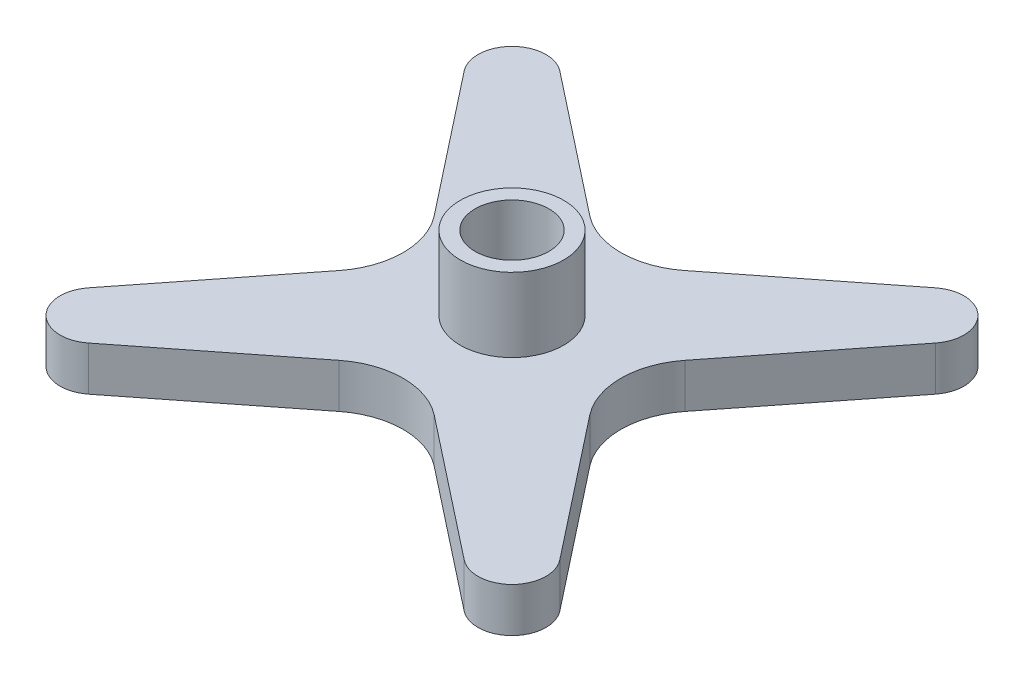
ISO-10303-21;
HEADER;
FILE_DESCRIPTION(('STEP AP214'),'2;1');
FILE_NAME('part.step','',(''),(''),'','','');
FILE_SCHEMA(('AUTOMOTIVE_DESIGN { 1 0 10303 214 1 1 1 1 }'));
ENDSEC;
DATA;
#1=APPLICATION_CONTEXT('core data for automotive mechanical design processes');
#2=APPLICATION_PROTOCOL_DEFINITION('international standard','automotive_design',2000,#1);
#3=PRODUCT_CONTEXT('',#1,'mechanical');
#4=PRODUCT('Part','Part','',(#3));
#5=PRODUCT_RELATED_PRODUCT_CATEGORY('part','',(#4));
#6=PRODUCT_DEFINITION_FORMATION('','',#4);
#7=PRODUCT_DEFINITION_CONTEXT('part definition',#1,'design');
#8=PRODUCT_DEFINITION('design','',#6,#7);
#9=PRODUCT_DEFINITION_SHAPE('','',#8);
#10=(LENGTH_UNIT() NAMED_UNIT(*) SI_UNIT(.MILLI.,.METRE.));
#11=(NAMED_UNIT(*) PLANE_ANGLE_UNIT() SI_UNIT($,.RADIAN.));
#12=(NAMED_UNIT(*) SI_UNIT($,.STERADIAN.) SOLID_ANGLE_UNIT());
#13=UNCERTAINTY_MEASURE_WITH_UNIT(LENGTH_MEASURE(1.E-05),#10,'distance_accuracy_value','');
#14=(GEOMETRIC_REPRESENTATION_CONTEXT(3) GLOBAL_UNCERTAINTY_ASSIGNED_CONTEXT((#13)) GLOBAL_UNIT_ASSIGNED_CONTEXT((#10,
#11,#12)) REPRESENTATION_CONTEXT('',''));
#15=CARTESIAN_POINT('',(0.,0.,0.));
#16=DIRECTION('',(0.,0.,1.));
#17=DIRECTION('',(1.,0.,0.));
#18=AXIS2_PLACEMENT_3D('',#15,#16,#17);
#19=CARTESIAN_POINT('',(14.142135623731,25.,-14.1421356237309));
#20=DIRECTION('',(0.,-1.,0.));
#21=DIRECTION('',(0.,0.,-1.));
#22=AXIS2_PLACEMENT_3D('',#19,#20,#21);
#23=CYLINDRICAL_SURFACE('',#22,2.3036334435409);
#24=CARTESIAN_POINT('',(14.142135623731,22.,-14.1421356237309));
#25=DIRECTION('',(0.,1.,0.));
#26=DIRECTION('',(0.,0.,1.));
#27=AXIS2_PLACEMENT_3D('',#24,#25,#26);
#28=CIRCLE('',#27,2.3036334435409);
#29=CARTESIAN_POINT('',(15.9528166490308,22.,-12.7180003538848));
#30=VERTEX_POINT('',#29);
#31=CARTESIAN_POINT('',(12.7180003538849,22.,-15.9528166490306));
#32=VERTEX_POINT('',#31);
#33=EDGE_CURVE('E184',#30,#32,#28,.T.);
#34=ORIENTED_EDGE('',*,*,#33,.T.);
#35=DIRECTION('',(0.,-1.,0.));
#36=VECTOR('',#35,1.);
#37=CARTESIAN_POINT('',(12.7180003538849,25.,-15.9528166490306));
#38=LINE('',#37,#36);
#39=CARTESIAN_POINT('',(12.7180003538849,25.,-15.9528166490306));
#40=VERTEX_POINT('',#39);
#41=EDGE_CURVE('E47',#40,#32,#38,.T.);
#42=ORIENTED_EDGE('',*,*,#41,.F.);
#43=CARTESIAN_POINT('',(14.142135623731,25.,-14.1421356237309));
#44=DIRECTION('',(0.,1.,0.));
#45=DIRECTION('',(0.,0.,1.));
#46=AXIS2_PLACEMENT_3D('',#43,#44,#45);
#47=CIRCLE('',#46,2.3036334435409);
#48=CARTESIAN_POINT('',(15.9528166490308,25.,-12.7180003538848));
#49=VERTEX_POINT('',#48);
#50=EDGE_CURVE('E215',#49,#40,#47,.T.);
#51=ORIENTED_EDGE('',*,*,#50,.F.);
#52=DIRECTION('',(0.,-1.,0.));
#53=VECTOR('',#52,1.);
#54=CARTESIAN_POINT('',(15.9528166490308,25.,-12.7180003538848));
#55=LINE('',#54,#53);
#56=EDGE_CURVE('E180',#49,#30,#55,.T.);
#57=ORIENTED_EDGE('',*,*,#56,.T.);
#58=EDGE_LOOP('',(#34,#42,#51,#57));
#59=FACE_BOUND('',#58,.T.);
#60=ADVANCED_FACE('F39',(#59),#23,.T.);
#61=CARTESIAN_POINT('',(12.7180003538849,25.,-15.9528166490306));
#62=DIRECTION('',(0.618212621386955,0.,0.786010912620092));
#63=DIRECTION('',(0.786010912620092,0.,-0.618212621386955));
#64=AXIS2_PLACEMENT_3D('',#61,#62,#63);
#65=PLANE('',#64);
#66=DIRECTION('',(-0.786010912620092,0.,0.618212621386955));
#67=VECTOR('',#66,1.);
#68=CARTESIAN_POINT('',(12.7180003538849,22.,-15.9528166490306));
#69=LINE('',#68,#67);
#70=CARTESIAN_POINT('',(3.21470563121222,22.,-8.47829352474935));
#71=VERTEX_POINT('',#70);
#72=EDGE_CURVE('E187',#32,#71,#69,.T.);
#73=ORIENTED_EDGE('',*,*,#72,.T.);
#74=DIRECTION('',(0.,-1.,0.));
#75=VECTOR('',#74,1.);
#76=CARTESIAN_POINT('',(3.21470563121222,25.,-8.47829352474935));
#77=LINE('',#76,#75);
#78=CARTESIAN_POINT('',(3.21470563121222,25.,-8.47829352474935));
#79=VERTEX_POINT('',#78);
#80=EDGE_CURVE('E249',#79,#71,#77,.T.);
#81=ORIENTED_EDGE('',*,*,#80,.F.);
#82=DIRECTION('',(-0.786010912620092,0.,0.618212621386955));
#83=VECTOR('',#82,1.);
#84=CARTESIAN_POINT('',(12.7180003538849,25.,-15.9528166490306));
#85=LINE('',#84,#83);
#86=EDGE_CURVE('E123',#40,#79,#85,.T.);
#87=ORIENTED_EDGE('',*,*,#86,.F.);
#88=ORIENTED_EDGE('',*,*,#41,.T.);
#89=EDGE_LOOP('',(#73,#81,#87,#88));
#90=FACE_BOUND('',#89,.T.);
#91=ADVANCED_FACE('F252',(#90),#65,.F.);
#92=CARTESIAN_POINT('',(0.,25.,-12.5655502703738));
#93=DIRECTION('',(0.,-1.,0.));
#94=DIRECTION('',(0.,0.,-1.));
#95=AXIS2_PLACEMENT_3D('',#92,#93,#94);
#96=CYLINDRICAL_SURFACE('',#95,5.2);
#97=CARTESIAN_POINT('',(0.,22.,-12.5655502703738));
#98=DIRECTION('',(0.,-1.,0.));
#99=DIRECTION('',(0.,0.,1.));
#100=AXIS2_PLACEMENT_3D('',#97,#98,#99);
#101=CIRCLE('',#100,5.2);
#102=CARTESIAN_POINT('',(-3.21470563121214,22.,-8.47829352474938));
#103=VERTEX_POINT('',#102);
#104=EDGE_CURVE('E190',#71,#103,#101,.T.);
#105=ORIENTED_EDGE('',*,*,#104,.T.);
#106=DIRECTION('',(0.,-1.,0.));
#107=VECTOR('',#106,1.);
#108=CARTESIAN_POINT('',(-3.21470563121214,25.,-8.47829352474938));
#109=LINE('',#108,#107);
#110=CARTESIAN_POINT('',(-3.21470563121214,25.,-8.47829352474938));
#111=VERTEX_POINT('',#110);
#112=EDGE_CURVE('E246',#111,#103,#109,.T.);
#113=ORIENTED_EDGE('',*,*,#112,.F.);
#114=CARTESIAN_POINT('',(0.,25.,-12.5655502703738));
#115=DIRECTION('',(0.,-1.,0.));
#116=DIRECTION('',(0.,0.,1.));
#117=AXIS2_PLACEMENT_3D('',#114,#115,#116);
#118=CIRCLE('',#117,5.2);
#119=EDGE_CURVE('E272',#79,#111,#118,.T.);
#120=ORIENTED_EDGE('',*,*,#119,.F.);
#121=ORIENTED_EDGE('',*,*,#80,.T.);
#122=EDGE_LOOP('',(#105,#113,#120,#121));
#123=FACE_BOUND('',#122,.T.);
#124=ADVANCED_FACE('F263',(#123),#96,.F.);
#125=CARTESIAN_POINT('',(-3.21470563121214,25.,-8.47829352474937));
#126=DIRECTION('',(-0.618212621386962,0.,0.786010912620086));
#127=DIRECTION('',(0.786010912620086,0.,0.618212621386962));
#128=AXIS2_PLACEMENT_3D('',#125,#126,#127);
#129=PLANE('',#128);
#130=DIRECTION('',(-0.786010912620086,0.,-0.618212621386962));
#131=VECTOR('',#130,1.);
#132=CARTESIAN_POINT('',(-3.21470563121214,22.,-8.47829352474937));
#133=LINE('',#132,#131);
#134=CARTESIAN_POINT('',(-12.7180003538848,22.,-15.9528166490307));
#135=VERTEX_POINT('',#134);
#136=EDGE_CURVE('E192',#103,#135,#133,.T.);
#137=ORIENTED_EDGE('',*,*,#136,.T.);
#138=DIRECTION('',(0.,-1.,0.));
#139=VECTOR('',#138,1.);
#140=CARTESIAN_POINT('',(-12.7180003538848,25.,-15.9528166490307));
#141=LINE('',#140,#139);
#142=CARTESIAN_POINT('',(-12.7180003538848,25.,-15.9528166490307));
#143=VERTEX_POINT('',#142);
#144=EDGE_CURVE('E243',#143,#135,#141,.T.);
#145=ORIENTED_EDGE('',*,*,#144,.F.);
#146=DIRECTION('',(-0.786010912620086,0.,-0.618212621386962));
#147=VECTOR('',#146,1.);
#148=CARTESIAN_POINT('',(-3.21470563121214,25.,-8.47829352474937));
#149=LINE('',#148,#147);
#150=EDGE_CURVE('E269',#111,#143,#149,.T.);
#151=ORIENTED_EDGE('',*,*,#150,.F.);
#152=ORIENTED_EDGE('',*,*,#112,.T.);
#153=EDGE_LOOP('',(#137,#145,#151,#152));
#154=FACE_BOUND('',#153,.T.);
#155=ADVANCED_FACE('F267',(#154),#129,.F.);
#156=CARTESIAN_POINT('',(-14.1421356237309,25.,-14.142135623731));
#157=DIRECTION('',(0.,-1.,0.));
#158=DIRECTION('',(0.,0.,-1.));
#159=AXIS2_PLACEMENT_3D('',#156,#157,#158);
#160=CYLINDRICAL_SURFACE('',#159,2.3036334435409);
#161=CARTESIAN_POINT('',(-14.1421356237309,22.,-14.142135623731));
#162=DIRECTION('',(0.,1.,0.));
#163=DIRECTION('',(0.,0.,1.));
#164=AXIS2_PLACEMENT_3D('',#161,#162,#163);
#165=CIRCLE('',#164,2.3036334435409);
#166=CARTESIAN_POINT('',(-15.9528166490306,22.,-12.7180003538849));
#167=VERTEX_POINT('',#166);
#168=EDGE_CURVE('E194',#135,#167,#165,.T.);
#169=ORIENTED_EDGE('',*,*,#168,.T.);
#170=DIRECTION('',(0.,-1.,0.));
#171=VECTOR('',#170,1.);
#172=CARTESIAN_POINT('',(-15.9528166490306,25.,-12.7180003538849));
#173=LINE('',#172,#171);
#174=CARTESIAN_POINT('',(-15.9528166490306,25.,-12.7180003538849));
#175=VERTEX_POINT('',#174);
#176=EDGE_CURVE('E240',#175,#167,#173,.T.);
#177=ORIENTED_EDGE('',*,*,#176,.F.);
#178=CARTESIAN_POINT('',(-14.1421356237309,25.,-14.142135623731));
#179=DIRECTION('',(0.,1.,0.));
#180=DIRECTION('',(0.,0.,1.));
#181=AXIS2_PLACEMENT_3D('',#178,#179,#180);
#182=CIRCLE('',#181,2.3036334435409);
#183=EDGE_CURVE('E271',#143,#175,#182,.T.);
#184=ORIENTED_EDGE('',*,*,#183,.F.);
#185=ORIENTED_EDGE('',*,*,#144,.T.);
#186=EDGE_LOOP('',(#169,#177,#184,#185));
#187=FACE_BOUND('',#186,.T.);
#188=ADVANCED_FACE('F331',(#187),#160,.T.);
#189=CARTESIAN_POINT('',(-15.9528166490306,25.,-12.7180003538849));
#190=DIRECTION('',(0.786010912620092,0.,-0.618212621386955));
#191=DIRECTION('',(-0.618212621386955,0.,-0.786010912620092));
#192=AXIS2_PLACEMENT_3D('',#189,#190,#191);
#193=PLANE('',#192);
#194=DIRECTION('',(0.618212621386955,0.,0.786010912620092));
#195=VECTOR('',#194,1.);
#196=CARTESIAN_POINT('',(-15.9528166490306,22.,-12.7180003538849));
#197=LINE('',#196,#195);
#198=CARTESIAN_POINT('',(-8.47829352474935,22.,-3.21470563121222));
#199=VERTEX_POINT('',#198);
#200=EDGE_CURVE('E196',#167,#199,#197,.T.);
#201=ORIENTED_EDGE('',*,*,#200,.T.);
#202=DIRECTION('',(0.,-1.,0.));
#203=VECTOR('',#202,1.);
#204=CARTESIAN_POINT('',(-8.47829352474935,25.,-3.21470563121222));
#205=LINE('',#204,#203);
#206=CARTESIAN_POINT('',(-8.47829352474935,25.,-3.21470563121222));
#207=VERTEX_POINT('',#206);
#208=EDGE_CURVE('E237',#207,#199,#205,.T.);
#209=ORIENTED_EDGE('',*,*,#208,.F.);
#210=DIRECTION('',(0.618212621386955,0.,0.786010912620092));
#211=VECTOR('',#210,1.);
#212=CARTESIAN_POINT('',(-15.9528166490306,25.,-12.7180003538849));
#213=LINE('',#212,#211);
#214=EDGE_CURVE('E274',#175,#207,#213,.T.);
#215=ORIENTED_EDGE('',*,*,#214,.F.);
#216=ORIENTED_EDGE('',*,*,#176,.T.);
#217=EDGE_LOOP('',(#201,#209,#215,#216));
#218=FACE_BOUND('',#217,.T.);
#219=ADVANCED_FACE('F328',(#218),#193,.F.);
#220=CARTESIAN_POINT('',(-12.5655502703738,25.,0.));
#221=DIRECTION('',(0.,-1.,0.));
#222=DIRECTION('',(0.,0.,-1.));
#223=AXIS2_PLACEMENT_3D('',#220,#221,#222);
#224=CYLINDRICAL_SURFACE('',#223,5.2);
#225=CARTESIAN_POINT('',(-12.5655502703738,22.,0.));
#226=DIRECTION('',(0.,-1.,0.));
#227=DIRECTION('',(0.,0.,1.));
#228=AXIS2_PLACEMENT_3D('',#225,#226,#227);
#229=CIRCLE('',#228,5.2);
#230=CARTESIAN_POINT('',(-8.47829352474938,22.,3.21470563121215));
#231=VERTEX_POINT('',#230);
#232=EDGE_CURVE('E198',#199,#231,#229,.T.);
#233=ORIENTED_EDGE('',*,*,#232,.T.);
#234=DIRECTION('',(0.,-1.,0.));
#235=VECTOR('',#234,1.);
#236=CARTESIAN_POINT('',(-8.47829352474938,25.,3.21470563121215));
#237=LINE('',#236,#235);
#238=CARTESIAN_POINT('',(-8.47829352474938,25.,3.21470563121215));
#239=VERTEX_POINT('',#238);
#240=EDGE_CURVE('E234',#239,#231,#237,.T.);
#241=ORIENTED_EDGE('',*,*,#240,.F.);
#242=CARTESIAN_POINT('',(-12.5655502703738,25.,0.));
#243=DIRECTION('',(0.,-1.,0.));
#244=DIRECTION('',(0.,0.,1.));
#245=AXIS2_PLACEMENT_3D('',#242,#243,#244);
#246=CIRCLE('',#245,5.2);
#247=EDGE_CURVE('E280',#207,#239,#246,.T.);
#248=ORIENTED_EDGE('',*,*,#247,.F.);
#249=ORIENTED_EDGE('',*,*,#208,.T.);
#250=EDGE_LOOP('',(#233,#241,#248,#249));
#251=FACE_BOUND('',#250,.T.);
#252=ADVANCED_FACE('F324',(#251),#224,.F.);
#253=CARTESIAN_POINT('',(-8.47829352474938,25.,3.21470563121215));
#254=DIRECTION('',(0.786010912620086,0.,0.618212621386962));
#255=DIRECTION('',(0.618212621386962,0.,-0.786010912620086));
#256=AXIS2_PLACEMENT_3D('',#253,#254,#255);
#257=PLANE('',#256);
#258=DIRECTION('',(-0.618212621386962,0.,0.786010912620086));
#259=VECTOR('',#258,1.);
#260=CARTESIAN_POINT('',(-8.47829352474938,22.,3.21470563121215));
#261=LINE('',#260,#259);
#262=CARTESIAN_POINT('',(-15.9528166490308,22.,12.7180003538848));
#263=VERTEX_POINT('',#262);
#264=EDGE_CURVE('E200',#231,#263,#261,.T.);
#265=ORIENTED_EDGE('',*,*,#264,.T.);
#266=DIRECTION('',(0.,-1.,0.));
#267=VECTOR('',#266,1.);
#268=CARTESIAN_POINT('',(-15.9528166490308,25.,12.7180003538848));
#269=LINE('',#268,#267);
#270=CARTESIAN_POINT('',(-15.9528166490308,25.,12.7180003538848));
#271=VERTEX_POINT('',#270);
#272=EDGE_CURVE('E231',#271,#263,#269,.T.);
#273=ORIENTED_EDGE('',*,*,#272,.F.);
#274=DIRECTION('',(-0.618212621386962,0.,0.786010912620086));
#275=VECTOR('',#274,1.);
#276=CARTESIAN_POINT('',(-8.47829352474938,25.,3.21470563121215));
#277=LINE('',#276,#275);
#278=EDGE_CURVE('E282',#239,#271,#277,.T.);
#279=ORIENTED_EDGE('',*,*,#278,.F.);
#280=ORIENTED_EDGE('',*,*,#240,.T.);
#281=EDGE_LOOP('',(#265,#273,#279,#280));
#282=FACE_BOUND('',#281,.T.);
#283=ADVANCED_FACE('F319',(#282),#257,.F.);
#284=CARTESIAN_POINT('',(-14.142135623731,25.,14.1421356237309));
#285=DIRECTION('',(0.,-1.,0.));
#286=DIRECTION('',(0.,0.,-1.));
#287=AXIS2_PLACEMENT_3D('',#284,#285,#286);
#288=CYLINDRICAL_SURFACE('',#287,2.3036334435409);
#289=CARTESIAN_POINT('',(-14.142135623731,22.,14.1421356237309));
#290=DIRECTION('',(0.,1.,0.));
#291=DIRECTION('',(0.,0.,1.));
#292=AXIS2_PLACEMENT_3D('',#289,#290,#291);
#293=CIRCLE('',#292,2.3036334435409);
#294=CARTESIAN_POINT('',(-12.7180003538849,22.,15.9528166490306));
#295=VERTEX_POINT('',#294);
#296=EDGE_CURVE('E202',#263,#295,#293,.T.);
#297=ORIENTED_EDGE('',*,*,#296,.T.);
#298=DIRECTION('',(0.,-1.,0.));
#299=VECTOR('',#298,1.);
#300=CARTESIAN_POINT('',(-12.7180003538849,25.,15.9528166490306));
#301=LINE('',#300,#299);
#302=CARTESIAN_POINT('',(-12.7180003538849,25.,15.9528166490306));
#303=VERTEX_POINT('',#302);
#304=EDGE_CURVE('E228',#303,#295,#301,.T.);
#305=ORIENTED_EDGE('',*,*,#304,.F.);
#306=CARTESIAN_POINT('',(-14.142135623731,25.,14.1421356237309));
#307=DIRECTION('',(0.,1.,0.));
#308=DIRECTION('',(0.,0.,1.));
#309=AXIS2_PLACEMENT_3D('',#306,#307,#308);
#310=CIRCLE('',#309,2.3036334435409);
#311=EDGE_CURVE('E284',#271,#303,#310,.T.);
#312=ORIENTED_EDGE('',*,*,#311,.F.);
#313=ORIENTED_EDGE('',*,*,#272,.T.);
#314=EDGE_LOOP('',(#297,#305,#312,#313));
#315=FACE_BOUND('',#314,.T.);
#316=ADVANCED_FACE('F313',(#315),#288,.T.);
#317=CARTESIAN_POINT('',(-12.7180003538849,25.,15.9528166490306));
#318=DIRECTION('',(-0.618212621386954,0.,-0.786010912620092));
#319=DIRECTION('',(-0.786010912620092,0.,0.618212621386954));
#320=AXIS2_PLACEMENT_3D('',#317,#318,#319);
#321=PLANE('',#320);
#322=DIRECTION('',(0.786010912620092,0.,-0.618212621386954));
#323=VECTOR('',#322,1.);
#324=CARTESIAN_POINT('',(-12.7180003538849,22.,15.9528166490306));
#325=LINE('',#324,#323);
#326=CARTESIAN_POINT('',(-3.21470563121222,22.,8.47829352474935));
#327=VERTEX_POINT('',#326);
#328=EDGE_CURVE('E204',#295,#327,#325,.T.);
#329=ORIENTED_EDGE('',*,*,#328,.T.);
#330=DIRECTION('',(0.,-1.,0.));
#331=VECTOR('',#330,1.);
#332=CARTESIAN_POINT('',(-3.21470563121222,25.,8.47829352474935));
#333=LINE('',#332,#331);
#334=CARTESIAN_POINT('',(-3.21470563121222,25.,8.47829352474935));
#335=VERTEX_POINT('',#334);
#336=EDGE_CURVE('E225',#335,#327,#333,.T.);
#337=ORIENTED_EDGE('',*,*,#336,.F.);
#338=DIRECTION('',(0.786010912620092,0.,-0.618212621386954));
#339=VECTOR('',#338,1.);
#340=CARTESIAN_POINT('',(-12.7180003538849,25.,15.9528166490306));
#341=LINE('',#340,#339);
#342=EDGE_CURVE('E286',#303,#335,#341,.T.);
#343=ORIENTED_EDGE('',*,*,#342,.F.);
#344=ORIENTED_EDGE('',*,*,#304,.T.);
#345=EDGE_LOOP('',(#329,#337,#343,#344));
#346=FACE_BOUND('',#345,.T.);
#347=ADVANCED_FACE('F309',(#346),#321,.F.);
#348=CARTESIAN_POINT('',(0.,25.,12.5655502703738));
#349=DIRECTION('',(0.,-1.,0.));
#350=DIRECTION('',(0.,0.,-1.));
#351=AXIS2_PLACEMENT_3D('',#348,#349,#350);
#352=CYLINDRICAL_SURFACE('',#351,5.2);
#353=CARTESIAN_POINT('',(0.,22.,12.5655502703738));
#354=DIRECTION('',(0.,-1.,0.));
#355=DIRECTION('',(0.,0.,1.));
#356=AXIS2_PLACEMENT_3D('',#353,#354,#355);
#357=CIRCLE('',#356,5.2);
#358=CARTESIAN_POINT('',(3.21470563121215,22.,8.47829352474938));
#359=VERTEX_POINT('',#358);
#360=EDGE_CURVE('E206',#327,#359,#357,.T.);
#361=ORIENTED_EDGE('',*,*,#360,.T.);
#362=DIRECTION('',(0.,-1.,0.));
#363=VECTOR('',#362,1.);
#364=CARTESIAN_POINT('',(3.21470563121215,25.,8.47829352474938));
#365=LINE('',#364,#363);
#366=CARTESIAN_POINT('',(3.21470563121215,25.,8.47829352474938));
#367=VERTEX_POINT('',#366);
#368=EDGE_CURVE('E222',#367,#359,#365,.T.);
#369=ORIENTED_EDGE('',*,*,#368,.F.);
#370=CARTESIAN_POINT('',(0.,25.,12.5655502703738));
#371=DIRECTION('',(0.,-1.,0.));
#372=DIRECTION('',(0.,0.,1.));
#373=AXIS2_PLACEMENT_3D('',#370,#371,#372);
#374=CIRCLE('',#373,5.2);
#375=EDGE_CURVE('E288',#335,#367,#374,.T.);
#376=ORIENTED_EDGE('',*,*,#375,.F.);
#377=ORIENTED_EDGE('',*,*,#336,.T.);
#378=EDGE_LOOP('',(#361,#369,#376,#377));
#379=FACE_BOUND('',#378,.T.);
#380=ADVANCED_FACE('F305',(#379),#352,.F.);
#381=CARTESIAN_POINT('',(3.21470563121215,25.,8.47829352474938));
#382=DIRECTION('',(0.618212621386962,0.,-0.786010912620086));
#383=DIRECTION('',(-0.786010912620086,0.,-0.618212621386962));
#384=AXIS2_PLACEMENT_3D('',#381,#382,#383);
#385=PLANE('',#384);
#386=DIRECTION('',(0.786010912620086,0.,0.618212621386962));
#387=VECTOR('',#386,1.);
#388=CARTESIAN_POINT('',(3.21470563121215,22.,8.47829352474938));
#389=LINE('',#388,#387);
#390=CARTESIAN_POINT('',(12.7180003538848,22.,15.9528166490308));
#391=VERTEX_POINT('',#390);
#392=EDGE_CURVE('E208',#359,#391,#389,.T.);
#393=ORIENTED_EDGE('',*,*,#392,.T.);
#394=DIRECTION('',(0.,-1.,0.));
#395=VECTOR('',#394,1.);
#396=CARTESIAN_POINT('',(12.7180003538848,25.,15.9528166490308));
#397=LINE('',#396,#395);
#398=CARTESIAN_POINT('',(12.7180003538848,25.,15.9528166490308));
#399=VERTEX_POINT('',#398);
#400=EDGE_CURVE('E219',#399,#391,#397,.T.);
#401=ORIENTED_EDGE('',*,*,#400,.F.);
#402=DIRECTION('',(0.786010912620086,0.,0.618212621386962));
#403=VECTOR('',#402,1.);
#404=CARTESIAN_POINT('',(3.21470563121215,25.,8.47829352474938));
#405=LINE('',#404,#403);
#406=EDGE_CURVE('E290',#367,#399,#405,.T.);
#407=ORIENTED_EDGE('',*,*,#406,.F.);
#408=ORIENTED_EDGE('',*,*,#368,.T.);
#409=EDGE_LOOP('',(#393,#401,#407,#408));
#410=FACE_BOUND('',#409,.T.);
#411=ADVANCED_FACE('F296',(#410),#385,.F.);
#412=CARTESIAN_POINT('',(14.1421356237309,25.,14.142135623731));
#413=DIRECTION('',(0.,-1.,0.));
#414=DIRECTION('',(0.,0.,-1.));
#415=AXIS2_PLACEMENT_3D('',#412,#413,#414);
#416=CYLINDRICAL_SURFACE('',#415,2.3036334435409);
#417=CARTESIAN_POINT('',(14.1421356237309,22.,14.142135623731));
#418=DIRECTION('',(0.,1.,0.));
#419=DIRECTION('',(0.,0.,1.));
#420=AXIS2_PLACEMENT_3D('',#417,#418,#419);
#421=CIRCLE('',#420,2.3036334435409);
#422=CARTESIAN_POINT('',(15.9528166490306,22.,12.7180003538849));
#423=VERTEX_POINT('',#422);
#424=EDGE_CURVE('E210',#391,#423,#421,.T.);
#425=ORIENTED_EDGE('',*,*,#424,.T.);
#426=DIRECTION('',(0.,-1.,0.));
#427=VECTOR('',#426,1.);
#428=CARTESIAN_POINT('',(15.9528166490306,25.,12.7180003538849));
#429=LINE('',#428,#427);
#430=CARTESIAN_POINT('',(15.9528166490306,25.,12.7180003538849));
#431=VERTEX_POINT('',#430);
#432=EDGE_CURVE('E175',#431,#423,#429,.T.);
#433=ORIENTED_EDGE('',*,*,#432,.F.);
#434=CARTESIAN_POINT('',(14.1421356237309,25.,14.142135623731));
#435=DIRECTION('',(0.,1.,0.));
#436=DIRECTION('',(0.,0.,1.));
#437=AXIS2_PLACEMENT_3D('',#434,#435,#436);
#438=CIRCLE('',#437,2.3036334435409);
#439=EDGE_CURVE('E166',#399,#431,#438,.T.);
#440=ORIENTED_EDGE('',*,*,#439,.F.);
#441=ORIENTED_EDGE('',*,*,#400,.T.);
#442=EDGE_LOOP('',(#425,#433,#440,#441));
#443=FACE_BOUND('',#442,.T.);
#444=ADVANCED_FACE('F300',(#443),#416,.T.);
#445=CARTESIAN_POINT('',(15.9528166490306,25.,12.7180003538849));
#446=DIRECTION('',(-0.786010912620092,0.,0.618212621386954));
#447=DIRECTION('',(0.618212621386954,0.,0.786010912620092));
#448=AXIS2_PLACEMENT_3D('',#445,#446,#447);
#449=PLANE('',#448);
#450=DIRECTION('',(-0.618212621386954,0.,-0.786010912620092));
#451=VECTOR('',#450,1.);
#452=CARTESIAN_POINT('',(15.9528166490306,22.,12.7180003538849));
#453=LINE('',#452,#451);
#454=CARTESIAN_POINT('',(8.47829352474935,22.,3.21470563121222));
#455=VERTEX_POINT('',#454);
#456=EDGE_CURVE('E174',#423,#455,#453,.T.);
#457=ORIENTED_EDGE('',*,*,#456,.T.);
#458=DIRECTION('',(0.,-1.,0.));
#459=VECTOR('',#458,1.);
#460=CARTESIAN_POINT('',(8.47829352474935,25.,3.21470563121222));
#461=LINE('',#460,#459);
#462=CARTESIAN_POINT('',(8.47829352474935,25.,3.21470563121222));
#463=VERTEX_POINT('',#462);
#464=EDGE_CURVE('E171',#463,#455,#461,.T.);
#465=ORIENTED_EDGE('',*,*,#464,.F.);
#466=DIRECTION('',(-0.618212621386954,0.,-0.786010912620092));
#467=VECTOR('',#466,1.);
#468=CARTESIAN_POINT('',(15.9528166490306,25.,12.7180003538849));
#469=LINE('',#468,#467);
#470=EDGE_CURVE('E160',#431,#463,#469,.T.);
#471=ORIENTED_EDGE('',*,*,#470,.F.);
#472=ORIENTED_EDGE('',*,*,#432,.T.);
#473=EDGE_LOOP('',(#457,#465,#471,#472));
#474=FACE_BOUND('',#473,.T.);
#475=ADVANCED_FACE('F172',(#474),#449,.F.);
#476=CARTESIAN_POINT('',(12.5655502703738,25.,0.));
#477=DIRECTION('',(0.,-1.,0.));
#478=DIRECTION('',(0.,0.,-1.));
#479=AXIS2_PLACEMENT_3D('',#476,#477,#478);
#480=CYLINDRICAL_SURFACE('',#479,5.2);
#481=CARTESIAN_POINT('',(12.5655502703738,22.,0.));
#482=DIRECTION('',(0.,-1.,0.));
#483=DIRECTION('',(0.,0.,1.));
#484=AXIS2_PLACEMENT_3D('',#481,#482,#483);
#485=CIRCLE('',#484,5.2);
#486=CARTESIAN_POINT('',(8.47829352474938,22.,-3.21470563121215));
#487=VERTEX_POINT('',#486);
#488=EDGE_CURVE('E108',#455,#487,#485,.T.);
#489=ORIENTED_EDGE('',*,*,#488,.T.);
#490=DIRECTION('',(0.,-1.,0.));
#491=VECTOR('',#490,1.);
#492=CARTESIAN_POINT('',(8.47829352474938,25.,-3.21470563121215));
#493=LINE('',#492,#491);
#494=CARTESIAN_POINT('',(8.47829352474938,25.,-3.21470563121215));
#495=VERTEX_POINT('',#494);
#496=EDGE_CURVE('E176',#495,#487,#493,.T.);
#497=ORIENTED_EDGE('',*,*,#496,.F.);
#498=CARTESIAN_POINT('',(12.5655502703738,25.,0.));
#499=DIRECTION('',(0.,-1.,0.));
#500=DIRECTION('',(0.,0.,1.));
#501=AXIS2_PLACEMENT_3D('',#498,#499,#500);
#502=CIRCLE('',#501,5.2);
#503=EDGE_CURVE('E164',#463,#495,#502,.T.);
#504=ORIENTED_EDGE('',*,*,#503,.F.);
#505=ORIENTED_EDGE('',*,*,#464,.T.);
#506=EDGE_LOOP('',(#489,#497,#504,#505));
#507=FACE_BOUND('',#506,.T.);
#508=ADVANCED_FACE('F178',(#507),#480,.F.);
#509=CARTESIAN_POINT('',(8.47829352474938,25.,-3.21470563121214));
#510=DIRECTION('',(-0.786010912620086,0.,-0.618212621386962));
#511=DIRECTION('',(-0.618212621386962,0.,0.786010912620086));
#512=AXIS2_PLACEMENT_3D('',#509,#510,#511);
#513=PLANE('',#512);
#514=DIRECTION('',(0.618212621386962,0.,-0.786010912620086));
#515=VECTOR('',#514,1.);
#516=CARTESIAN_POINT('',(8.47829352474938,22.,-3.21470563121214));
#517=LINE('',#516,#515);
#518=EDGE_CURVE('E114',#487,#30,#517,.T.);
#519=ORIENTED_EDGE('',*,*,#518,.T.);
#520=ORIENTED_EDGE('',*,*,#56,.F.);
#521=DIRECTION('',(0.618212621386962,0.,-0.786010912620086));
#522=VECTOR('',#521,1.);
#523=CARTESIAN_POINT('',(8.47829352474938,25.,-3.21470563121214));
#524=LINE('',#523,#522);
#525=EDGE_CURVE('E55',#495,#49,#524,.T.);
#526=ORIENTED_EDGE('',*,*,#525,.F.);
#527=ORIENTED_EDGE('',*,*,#496,.T.);
#528=EDGE_LOOP('',(#519,#520,#526,#527));
#529=FACE_BOUND('',#528,.T.);
#530=ADVANCED_FACE('F419',(#529),#513,.F.);
#531=CARTESIAN_POINT('',(14.142135623731,25.,-14.1421356237309));
#532=DIRECTION('',(0.,1.,0.));
#533=DIRECTION('',(0.,0.,1.));
#534=AXIS2_PLACEMENT_3D('',#531,#532,#533);
#535=PLANE('',#534);
#536=CARTESIAN_POINT('',(0.,25.,0.));
#537=DIRECTION('',(0.,1.,0.));
#538=DIRECTION('',(0.,0.,1.));
#539=AXIS2_PLACEMENT_3D('',#536,#537,#538);
#540=CIRCLE('',#539,3.5);
#541=CARTESIAN_POINT('',(0.,25.,3.5));
#542=VERTEX_POINT('',#541);
#543=EDGE_CURVE('E477',#542,#542,#540,.T.);
#544=ORIENTED_EDGE('',*,*,#543,.F.);
#545=EDGE_LOOP('',(#544));
#546=FACE_BOUND('',#545,.T.);
#547=ORIENTED_EDGE('',*,*,#50,.T.);
#548=ORIENTED_EDGE('',*,*,#86,.T.);
#549=ORIENTED_EDGE('',*,*,#119,.T.);
#550=ORIENTED_EDGE('',*,*,#150,.T.);
#551=ORIENTED_EDGE('',*,*,#183,.T.);
#552=ORIENTED_EDGE('',*,*,#214,.T.);
#553=ORIENTED_EDGE('',*,*,#247,.T.);
#554=ORIENTED_EDGE('',*,*,#278,.T.);
#555=ORIENTED_EDGE('',*,*,#311,.T.);
#556=ORIENTED_EDGE('',*,*,#342,.T.);
#557=ORIENTED_EDGE('',*,*,#375,.T.);
#558=ORIENTED_EDGE('',*,*,#406,.T.);
#559=ORIENTED_EDGE('',*,*,#439,.T.);
#560=ORIENTED_EDGE('',*,*,#470,.T.);
#561=ORIENTED_EDGE('',*,*,#503,.T.);
#562=ORIENTED_EDGE('',*,*,#525,.T.);
#563=EDGE_LOOP('',(#547,#548,#549,#550,#551,#552,#553,#554,#555,#556,#557,#558,#559,#560,#561,#562));
#564=FACE_BOUND('',#563,.T.);
#565=ADVANCED_FACE('F162',(#546,#564),#535,.T.);
#566=CARTESIAN_POINT('',(14.142135623731,22.,-14.1421356237309));
#567=DIRECTION('',(0.,1.,0.));
#568=DIRECTION('',(0.,0.,1.));
#569=AXIS2_PLACEMENT_3D('',#566,#567,#568);
#570=PLANE('',#569);
#571=ORIENTED_EDGE('',*,*,#33,.F.);
#572=ORIENTED_EDGE('',*,*,#518,.F.);
#573=ORIENTED_EDGE('',*,*,#488,.F.);
#574=ORIENTED_EDGE('',*,*,#456,.F.);
#575=ORIENTED_EDGE('',*,*,#424,.F.);
#576=ORIENTED_EDGE('',*,*,#392,.F.);
#577=ORIENTED_EDGE('',*,*,#360,.F.);
#578=ORIENTED_EDGE('',*,*,#328,.F.);
#579=ORIENTED_EDGE('',*,*,#296,.F.);
#580=ORIENTED_EDGE('',*,*,#264,.F.);
#581=ORIENTED_EDGE('',*,*,#232,.F.);
#582=ORIENTED_EDGE('',*,*,#200,.F.);
#583=ORIENTED_EDGE('',*,*,#168,.F.);
#584=ORIENTED_EDGE('',*,*,#136,.F.);
#585=ORIENTED_EDGE('',*,*,#104,.F.);
#586=ORIENTED_EDGE('',*,*,#72,.F.);
#587=EDGE_LOOP('',(#571,#572,#573,#574,#575,#576,#577,#578,#579,#580,#581,#582,#583,#584,#585,#586));
#588=FACE_BOUND('',#587,.T.);
#589=ADVANCED_FACE('F257',(#588),#570,.F.);
#590=CARTESIAN_POINT('',(0.,30.,0.));
#591=DIRECTION('',(0.,1.,0.));
#592=DIRECTION('',(0.,0.,1.));
#593=AXIS2_PLACEMENT_3D('',#590,#591,#592);
#594=PLANE('',#593);
#595=CARTESIAN_POINT('',(0.,30.,0.));
#596=DIRECTION('',(0.,1.,0.));
#597=DIRECTION('',(0.,0.,1.));
#598=AXIS2_PLACEMENT_3D('',#595,#596,#597);
#599=CIRCLE('',#598,3.5);
#600=CARTESIAN_POINT('',(0.,30.,3.5));
#601=VERTEX_POINT('',#600);
#602=EDGE_CURVE('E188',#601,#601,#599,.T.);
#603=ORIENTED_EDGE('',*,*,#602,.T.);
#604=EDGE_LOOP('',(#603));
#605=FACE_BOUND('',#604,.T.);
#606=CARTESIAN_POINT('',(0.,30.,0.));
#607=DIRECTION('',(0.,1.,0.));
#608=DIRECTION('',(0.,0.,1.));
#609=AXIS2_PLACEMENT_3D('',#606,#607,#608);
#610=CIRCLE('',#609,2.5);
#611=CARTESIAN_POINT('',(0.,30.,2.5));
#612=VERTEX_POINT('',#611);
#613=EDGE_CURVE('E475',#612,#612,#610,.T.);
#614=ORIENTED_EDGE('',*,*,#613,.F.);
#615=EDGE_LOOP('',(#614));
#616=FACE_BOUND('',#615,.T.);
#617=ADVANCED_FACE('F441',(#605,#616),#594,.T.);
#618=CARTESIAN_POINT('',(0.,30.,0.));
#619=DIRECTION('',(0.,-1.,0.));
#620=DIRECTION('',(0.,0.,-1.));
#621=AXIS2_PLACEMENT_3D('',#618,#619,#620);
#622=CYLINDRICAL_SURFACE('',#621,3.5);
#623=ORIENTED_EDGE('',*,*,#602,.F.);
#624=EDGE_LOOP('',(#623));
#625=FACE_BOUND('',#624,.T.);
#626=ORIENTED_EDGE('',*,*,#543,.T.);
#627=EDGE_LOOP('',(#626));
#628=FACE_BOUND('',#627,.T.);
#629=ADVANCED_FACE('F447',(#625,#628),#622,.T.);
#630=CARTESIAN_POINT('',(0.,30.,0.));
#631=DIRECTION('',(0.,-1.,0.));
#632=DIRECTION('',(0.,0.,-1.));
#633=AXIS2_PLACEMENT_3D('',#630,#631,#632);
#634=CYLINDRICAL_SURFACE('',#633,2.5);
#635=ORIENTED_EDGE('',*,*,#613,.T.);
#636=EDGE_LOOP('',(#635));
#637=FACE_BOUND('',#636,.T.);
#638=CARTESIAN_POINT('',(0.,25.,0.));
#639=DIRECTION('',(0.,1.,0.));
#640=DIRECTION('',(0.,0.,1.));
#641=AXIS2_PLACEMENT_3D('',#638,#639,#640);
#642=CIRCLE('',#641,2.5);
#643=CARTESIAN_POINT('',(0.,25.,2.5));
#644=VERTEX_POINT('',#643);
#645=EDGE_CURVE('E11',#644,#644,#642,.F.);
#646=ORIENTED_EDGE('',*,*,#645,.T.);
#647=EDGE_LOOP('',(#646));
#648=FACE_BOUND('',#647,.T.);
#649=ADVANCED_FACE('F455',(#637,#648),#634,.F.);
#650=ORIENTED_EDGE('',*,*,#645,.F.);
#651=EDGE_LOOP('',(#650));
#652=FACE_BOUND('',#651,.T.);
#653=ADVANCED_FACE('F435',(#652),#535,.T.);
#654=CLOSED_SHELL('',(#60,#91,#124,#155,#188,#219,#252,#283,#316,#347,#380,#411,#444,#475,#508,
#530,#565,#589,#617,#629,#649,#653));
#655=MANIFOLD_SOLID_BREP('B2',#654);
#656=ADVANCED_BREP_SHAPE_REPRESENTATION('',(#18,#655),#14);
#657=SHAPE_DEFINITION_REPRESENTATION(#9,#656);
ENDSEC;
END-ISO-10303-21;
